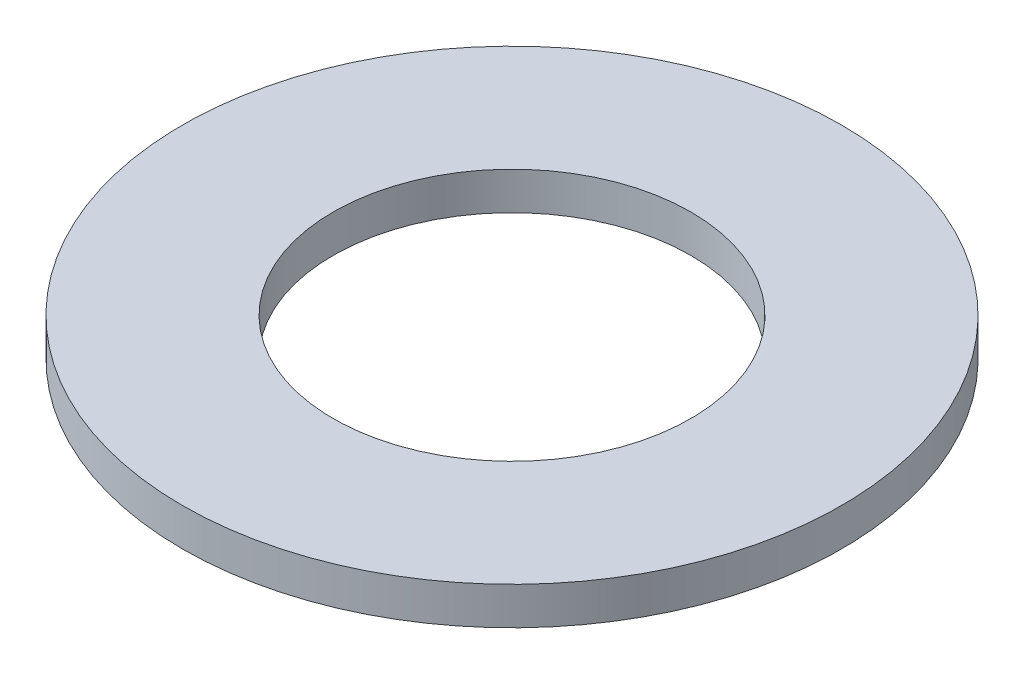
ISO-10303-21;
HEADER;
FILE_DESCRIPTION(('STEP AP214'),'2;1');
FILE_NAME('part.step','',(''),(''),'','','');
FILE_SCHEMA(('AUTOMOTIVE_DESIGN { 1 0 10303 214 1 1 1 1 }'));
ENDSEC;
DATA;
#1=APPLICATION_CONTEXT('core data for automotive mechanical design processes');
#2=APPLICATION_PROTOCOL_DEFINITION('international standard','automotive_design',2000,#1);
#3=PRODUCT_CONTEXT('',#1,'mechanical');
#4=PRODUCT('Part','Part','',(#3));
#5=PRODUCT_RELATED_PRODUCT_CATEGORY('part','',(#4));
#6=PRODUCT_DEFINITION_FORMATION('','',#4);
#7=PRODUCT_DEFINITION_CONTEXT('part definition',#1,'design');
#8=PRODUCT_DEFINITION('design','',#6,#7);
#9=PRODUCT_DEFINITION_SHAPE('','',#8);
#10=(LENGTH_UNIT() NAMED_UNIT(*) SI_UNIT(.MILLI.,.METRE.));
#11=(NAMED_UNIT(*) PLANE_ANGLE_UNIT() SI_UNIT($,.RADIAN.));
#12=(NAMED_UNIT(*) SI_UNIT($,.STERADIAN.) SOLID_ANGLE_UNIT());
#13=UNCERTAINTY_MEASURE_WITH_UNIT(LENGTH_MEASURE(1.E-05),#10,'distance_accuracy_value','');
#14=(GEOMETRIC_REPRESENTATION_CONTEXT(3) GLOBAL_UNCERTAINTY_ASSIGNED_CONTEXT((#13)) GLOBAL_UNIT_ASSIGNED_CONTEXT((#10,
#11,#12)) REPRESENTATION_CONTEXT('',''));
#15=CARTESIAN_POINT('',(0.,0.,0.));
#16=DIRECTION('',(0.,0.,1.));
#17=DIRECTION('',(1.,0.,0.));
#18=AXIS2_PLACEMENT_3D('',#15,#16,#17);
#19=CARTESIAN_POINT('',(0.,0.,0.));
#20=DIRECTION('',(0.,1.,0.));
#21=DIRECTION('',(0.,0.,1.));
#22=AXIS2_PLACEMENT_3D('',#19,#20,#21);
#23=PLANE('',#22);
#24=CARTESIAN_POINT('',(0.,0.,0.));
#25=DIRECTION('',(0.,-1.,0.));
#26=DIRECTION('',(0.,0.,-1.));
#27=AXIS2_PLACEMENT_3D('',#24,#25,#26);
#28=CIRCLE('',#27,4.826);
#29=CARTESIAN_POINT('',(0.,0.,-4.826));
#30=VERTEX_POINT('',#29);
#31=EDGE_CURVE('E35',#30,#30,#28,.F.);
#32=ORIENTED_EDGE('',*,*,#31,.T.);
#33=EDGE_LOOP('',(#32));
#34=FACE_BOUND('',#33,.T.);
#35=CARTESIAN_POINT('',(0.,0.,0.));
#36=DIRECTION('',(0.,-1.,0.));
#37=DIRECTION('',(0.,0.,-1.));
#38=AXIS2_PLACEMENT_3D('',#35,#36,#37);
#39=CIRCLE('',#38,8.89);
#40=CARTESIAN_POINT('',(0.,0.,-8.89));
#41=VERTEX_POINT('',#40);
#42=EDGE_CURVE('E26',#41,#41,#39,.F.);
#43=ORIENTED_EDGE('',*,*,#42,.F.);
#44=EDGE_LOOP('',(#43));
#45=FACE_BOUND('',#44,.T.);
#46=ADVANCED_FACE('F23',(#34,#45),#23,.F.);
#47=CARTESIAN_POINT('',(0.,1.016,0.));
#48=DIRECTION('',(0.,-1.,0.));
#49=DIRECTION('',(0.,0.,-1.));
#50=AXIS2_PLACEMENT_3D('',#47,#48,#49);
#51=CYLINDRICAL_SURFACE('',#50,8.89);
#52=ORIENTED_EDGE('',*,*,#42,.T.);
#53=EDGE_LOOP('',(#52));
#54=FACE_BOUND('',#53,.T.);
#55=CARTESIAN_POINT('',(0.,1.016,0.));
#56=DIRECTION('',(0.,-1.,0.));
#57=DIRECTION('',(0.,0.,-1.));
#58=AXIS2_PLACEMENT_3D('',#55,#56,#57);
#59=CIRCLE('',#58,8.89);
#60=CARTESIAN_POINT('',(0.,1.016,-8.89));
#61=VERTEX_POINT('',#60);
#62=EDGE_CURVE('E30',#61,#61,#59,.F.);
#63=ORIENTED_EDGE('',*,*,#62,.F.);
#64=EDGE_LOOP('',(#63));
#65=FACE_BOUND('',#64,.T.);
#66=ADVANCED_FACE('F43',(#54,#65),#51,.T.);
#67=CARTESIAN_POINT('',(0.,1.016,0.));
#68=DIRECTION('',(0.,-1.,0.));
#69=DIRECTION('',(0.,0.,-1.));
#70=AXIS2_PLACEMENT_3D('',#67,#68,#69);
#71=CYLINDRICAL_SURFACE('',#70,4.826);
#72=CARTESIAN_POINT('',(0.,1.016,0.));
#73=DIRECTION('',(0.,-1.,0.));
#74=DIRECTION('',(0.,0.,-1.));
#75=AXIS2_PLACEMENT_3D('',#72,#73,#74);
#76=CIRCLE('',#75,4.826);
#77=CARTESIAN_POINT('',(0.,1.016,-4.826));
#78=VERTEX_POINT('',#77);
#79=EDGE_CURVE('E12',#78,#78,#76,.T.);
#80=ORIENTED_EDGE('',*,*,#79,.F.);
#81=EDGE_LOOP('',(#80));
#82=FACE_BOUND('',#81,.T.);
#83=ORIENTED_EDGE('',*,*,#31,.F.);
#84=EDGE_LOOP('',(#83));
#85=FACE_BOUND('',#84,.T.);
#86=ADVANCED_FACE('F51',(#82,#85),#71,.F.);
#87=CARTESIAN_POINT('',(0.,1.016,0.));
#88=DIRECTION('',(0.,1.,0.));
#89=DIRECTION('',(0.,0.,1.));
#90=AXIS2_PLACEMENT_3D('',#87,#88,#89);
#91=PLANE('',#90);
#92=ORIENTED_EDGE('',*,*,#79,.T.);
#93=EDGE_LOOP('',(#92));
#94=FACE_BOUND('',#93,.T.);
#95=ORIENTED_EDGE('',*,*,#62,.T.);
#96=EDGE_LOOP('',(#95));
#97=FACE_BOUND('',#96,.T.);
#98=ADVANCED_FACE('F52',(#94,#97),#91,.T.);
#99=CLOSED_SHELL('',(#46,#66,#86,#98));
#100=MANIFOLD_SOLID_BREP('B1',#99);
#101=ADVANCED_BREP_SHAPE_REPRESENTATION('',(#18,#100),#14);
#102=SHAPE_DEFINITION_REPRESENTATION(#9,#101);
ENDSEC;
END-ISO-10303-21;
